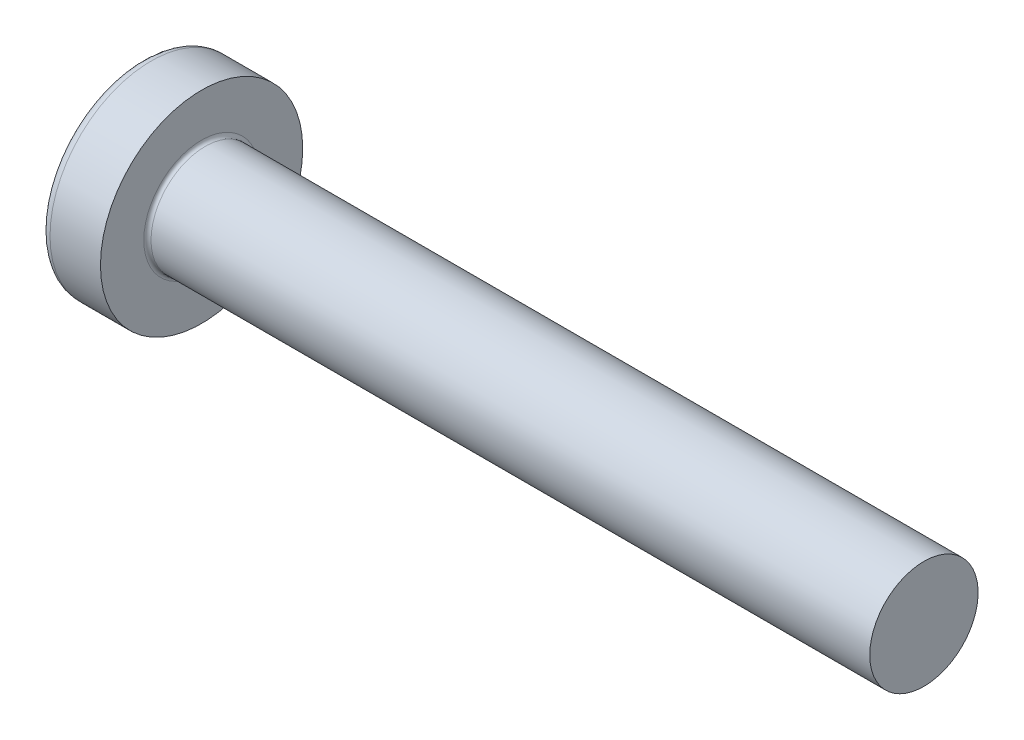
ISO-10303-21;
HEADER;
FILE_DESCRIPTION(('STEP AP214'),'2;1');
FILE_NAME('part.step','',(''),(''),'','','');
FILE_SCHEMA(('AUTOMOTIVE_DESIGN { 1 0 10303 214 1 1 1 1 }'));
ENDSEC;
DATA;
#1=APPLICATION_CONTEXT('core data for automotive mechanical design processes');
#2=APPLICATION_PROTOCOL_DEFINITION('international standard','automotive_design',2000,#1);
#3=PRODUCT_CONTEXT('',#1,'mechanical');
#4=PRODUCT('Part','Part','',(#3));
#5=PRODUCT_RELATED_PRODUCT_CATEGORY('part','',(#4));
#6=PRODUCT_DEFINITION_FORMATION('','',#4);
#7=PRODUCT_DEFINITION_CONTEXT('part definition',#1,'design');
#8=PRODUCT_DEFINITION('design','',#6,#7);
#9=PRODUCT_DEFINITION_SHAPE('','',#8);
#10=(LENGTH_UNIT() NAMED_UNIT(*) SI_UNIT(.MILLI.,.METRE.));
#11=(NAMED_UNIT(*) PLANE_ANGLE_UNIT() SI_UNIT($,.RADIAN.));
#12=(NAMED_UNIT(*) SI_UNIT($,.STERADIAN.) SOLID_ANGLE_UNIT());
#13=UNCERTAINTY_MEASURE_WITH_UNIT(LENGTH_MEASURE(1.E-05),#10,'distance_accuracy_value','');
#14=(GEOMETRIC_REPRESENTATION_CONTEXT(3) GLOBAL_UNCERTAINTY_ASSIGNED_CONTEXT((#13)) GLOBAL_UNIT_ASSIGNED_CONTEXT((#10,
#11,#12)) REPRESENTATION_CONTEXT('',''));
#15=CARTESIAN_POINT('',(0.,0.,0.));
#16=DIRECTION('',(0.,0.,1.));
#17=DIRECTION('',(1.,0.,0.));
#18=AXIS2_PLACEMENT_3D('',#15,#16,#17);
#19=CARTESIAN_POINT('',(5.,0.,0.));
#20=DIRECTION('',(-1.,0.,0.));
#21=DIRECTION('',(0.,1.,0.));
#22=AXIS2_PLACEMENT_3D('',#19,#20,#21);
#23=SPHERICAL_SURFACE('',#22,5.);
#24=CARTESIAN_POINT('',(0.775371598933733,0.,0.));
#25=DIRECTION('',(-1.,0.,0.));
#26=DIRECTION('',(0.,0.,1.));
#27=AXIS2_PLACEMENT_3D('',#24,#25,#26);
#28=CIRCLE('',#27,2.67441860465116);
#29=CARTESIAN_POINT('',(0.775371598933733,0.,2.67441860465116));
#30=VERTEX_POINT('',#29);
#31=EDGE_CURVE('E239',#30,#30,#28,.T.);
#32=ORIENTED_EDGE('',*,*,#31,.T.);
#33=EDGE_LOOP('',(#32));
#34=FACE_BOUND('',#33,.T.);
#35=CARTESIAN_POINT('',(0.0457951200896417,0.,0.));
#36=DIRECTION('',(1.,0.,0.));
#37=DIRECTION('',(0.,0.,-1.));
#38=AXIS2_PLACEMENT_3D('',#35,#36,#37);
#39=CIRCLE('',#38,0.675169614150692);
#40=CARTESIAN_POINT('',(0.0457951200896426,-0.369999999999998,-0.564760133040918));
#41=VERTEX_POINT('',#40);
#42=CARTESIAN_POINT('',(0.0457951200896417,-0.564760133040915,-0.37));
#43=VERTEX_POINT('',#42);
#44=EDGE_CURVE('E375',#41,#43,#39,.F.);
#45=ORIENTED_EDGE('',*,*,#44,.F.);
#46=CARTESIAN_POINT('',(5.,-0.37,0.));
#47=DIRECTION('',(0.,1.,0.));
#48=DIRECTION('',(0.,0.,1.));
#49=AXIS2_PLACEMENT_3D('',#46,#47,#48);
#50=CIRCLE('',#49,4.98629120689917);
#51=CARTESIAN_POINT('',(0.187869734228639,-0.369999999999995,-1.30633162146802));
#52=VERTEX_POINT('',#51);
#53=EDGE_CURVE('E301',#52,#41,#50,.T.);
#54=ORIENTED_EDGE('',*,*,#53,.F.);
#55=CARTESIAN_POINT('',(4.56358262530798,0.,0.875317983305919));
#56=DIRECTION('',(0.446197753347436,0.,-0.894934391398443));
#57=DIRECTION('',(-0.894934391398443,0.,-0.446197753347436));
#58=AXIS2_PLACEMENT_3D('',#55,#56,#57);
#59=CIRCLE('',#58,4.90340272700175);
#60=CARTESIAN_POINT('',(0.18786973422864,0.370000000000005,-1.30633162146802));
#61=VERTEX_POINT('',#60);
#62=EDGE_CURVE('E273',#52,#61,#59,.T.);
#63=ORIENTED_EDGE('',*,*,#62,.T.);
#64=CARTESIAN_POINT('',(5.,0.37,0.));
#65=DIRECTION('',(0.,-1.,0.));
#66=DIRECTION('',(0.,0.,-1.));
#67=AXIS2_PLACEMENT_3D('',#64,#65,#66);
#68=CIRCLE('',#67,4.98629120689917);
#69=CARTESIAN_POINT('',(0.0457951200896425,0.370000000000002,-0.564760133040916));
#70=VERTEX_POINT('',#69);
#71=EDGE_CURVE('E328',#70,#61,#68,.T.);
#72=ORIENTED_EDGE('',*,*,#71,.F.);
#73=CARTESIAN_POINT('',(0.0457951200896417,0.564760133040916,-0.37));
#74=VERTEX_POINT('',#73);
#75=EDGE_CURVE('E394',#74,#70,#39,.F.);
#76=ORIENTED_EDGE('',*,*,#75,.F.);
#77=CARTESIAN_POINT('',(5.,0.,-0.37));
#78=DIRECTION('',(0.,0.,1.));
#79=DIRECTION('',(1.,0.,0.));
#80=AXIS2_PLACEMENT_3D('',#77,#78,#79);
#81=CIRCLE('',#80,4.98629120689917);
#82=CARTESIAN_POINT('',(0.18786973422864,1.30633162146802,-0.37));
#83=VERTEX_POINT('',#82);
#84=EDGE_CURVE('E267',#83,#74,#81,.T.);
#85=ORIENTED_EDGE('',*,*,#84,.F.);
#86=CARTESIAN_POINT('',(4.56358262530798,-0.87531798330592,0.));
#87=DIRECTION('',(0.446197753347436,0.894934391398443,0.));
#88=DIRECTION('',(-0.894934391398442,0.446197753347436,0.));
#89=AXIS2_PLACEMENT_3D('',#86,#87,#88);
#90=CIRCLE('',#89,4.90340272700175);
#91=CARTESIAN_POINT('',(0.18786973422864,1.30633162146802,0.37));
#92=VERTEX_POINT('',#91);
#93=EDGE_CURVE('E270',#83,#92,#90,.T.);
#94=ORIENTED_EDGE('',*,*,#93,.T.);
#95=CARTESIAN_POINT('',(5.,0.,0.37));
#96=DIRECTION('',(0.,0.,-1.));
#97=DIRECTION('',(0.,1.,0.));
#98=AXIS2_PLACEMENT_3D('',#95,#96,#97);
#99=CIRCLE('',#98,4.98629120689917);
#100=CARTESIAN_POINT('',(0.0457951200896417,0.564760133040916,0.37));
#101=VERTEX_POINT('',#100);
#102=EDGE_CURVE('E263',#101,#92,#99,.T.);
#103=ORIENTED_EDGE('',*,*,#102,.F.);
#104=CARTESIAN_POINT('',(0.0457951200896434,0.369999999999998,0.564760133040918));
#105=VERTEX_POINT('',#104);
#106=EDGE_CURVE('E393',#105,#101,#39,.F.);
#107=ORIENTED_EDGE('',*,*,#106,.F.);
#108=CARTESIAN_POINT('',(0.18786973422864,0.369999999999995,1.30633162146802));
#109=VERTEX_POINT('',#108);
#110=EDGE_CURVE('E283',#109,#105,#68,.T.);
#111=ORIENTED_EDGE('',*,*,#110,.F.);
#112=CARTESIAN_POINT('',(4.56358262530798,0.,-0.87531798330592));
#113=DIRECTION('',(0.446197753347436,0.,0.894934391398443));
#114=DIRECTION('',(0.894934391398442,0.,-0.446197753347436));
#115=AXIS2_PLACEMENT_3D('',#112,#113,#114);
#116=CIRCLE('',#115,4.90340272700175);
#117=CARTESIAN_POINT('',(0.18786973422864,-0.370000000000005,1.30633162146802));
#118=VERTEX_POINT('',#117);
#119=EDGE_CURVE('E50',#109,#118,#116,.T.);
#120=ORIENTED_EDGE('',*,*,#119,.T.);
#121=CARTESIAN_POINT('',(0.0457951200896421,-0.370000000000002,0.564760133040916));
#122=VERTEX_POINT('',#121);
#123=EDGE_CURVE('E280',#122,#118,#50,.T.);
#124=ORIENTED_EDGE('',*,*,#123,.F.);
#125=CARTESIAN_POINT('',(0.0457951200896417,-0.564760133040916,0.37));
#126=VERTEX_POINT('',#125);
#127=EDGE_CURVE('E433',#126,#122,#39,.F.);
#128=ORIENTED_EDGE('',*,*,#127,.F.);
#129=CARTESIAN_POINT('',(0.187869734228639,-1.30633162146802,0.37));
#130=VERTEX_POINT('',#129);
#131=EDGE_CURVE('E264',#130,#126,#99,.T.);
#132=ORIENTED_EDGE('',*,*,#131,.F.);
#133=CARTESIAN_POINT('',(4.56358262530798,0.875317983305919,0.));
#134=DIRECTION('',(0.446197753347436,-0.894934391398443,0.));
#135=DIRECTION('',(0.894934391398443,0.446197753347436,0.));
#136=AXIS2_PLACEMENT_3D('',#133,#134,#135);
#137=CIRCLE('',#136,4.90340272700175);
#138=CARTESIAN_POINT('',(0.18786973422864,-1.30633162146802,-0.37));
#139=VERTEX_POINT('',#138);
#140=EDGE_CURVE('E260',#130,#139,#137,.T.);
#141=ORIENTED_EDGE('',*,*,#140,.T.);
#142=EDGE_CURVE('E65',#43,#139,#81,.T.);
#143=ORIENTED_EDGE('',*,*,#142,.F.);
#144=EDGE_LOOP('',(#45,#54,#63,#72,#76,#85,#94,#103,#107,#111,#120,#124,#128,#132,#141,#143));
#145=FACE_BOUND('',#144,.T.);
#146=ADVANCED_FACE('F36',(#34,#145),#23,.T.);
#147=CARTESIAN_POINT('',(1.75,0.527482331818931,-0.37));
#148=DIRECTION('',(0.,0.,1.));
#149=DIRECTION('',(1.,0.,0.));
#150=AXIS2_PLACEMENT_3D('',#147,#148,#149);
#151=PLANE('',#150);
#152=ORIENTED_EDGE('',*,*,#84,.T.);
#153=CARTESIAN_POINT('',(-0.987293237053716,0.649401255967161,-0.37));
#154=CARTESIAN_POINT('',(-0.781914975317084,0.632865887002871,-0.37));
#155=CARTESIAN_POINT('',(-0.576547882393372,0.616188977635081,-0.37));
#156=CARTESIAN_POINT('',(-0.165841599226327,0.582441031964227,-0.37));
#157=CARTESIAN_POINT('',(0.0394975903090452,0.56536998705488,-0.37));
#158=CARTESIAN_POINT('',(0.450133475422572,0.530723441326535,-0.37));
#159=CARTESIAN_POINT('',(0.655430171010573,0.513147940624557,-0.37));
#160=CARTESIAN_POINT('',(1.06596140177934,0.477314957985794,-0.37));
#161=CARTESIAN_POINT('',(1.2711959378071,0.459057485806066,-0.37));
#162=CARTESIAN_POINT('',(1.61065292365626,0.428051938688768,-0.37));
#163=CARTESIAN_POINT('',(1.74490059995643,0.415580824990931,-0.37));
#164=CARTESIAN_POINT('',(2.01334321762763,0.390092023404979,-0.37));
#165=CARTESIAN_POINT('',(2.14753815934577,0.377074339177353,-0.37));
#166=CARTESIAN_POINT('',(2.41586354151957,0.350315629452843,-0.37));
#167=CARTESIAN_POINT('',(2.5499939784531,0.33657456817765,-0.37));
#168=CARTESIAN_POINT('',(2.81814173295471,0.308004077741875,-0.37));
#169=CARTESIAN_POINT('',(2.95215904765134,0.293174621747065,-0.37));
#170=CARTESIAN_POINT('',(3.0860955068368,0.277618485071816,-0.37));
#171=B_SPLINE_CURVE_WITH_KNOTS('',3,(#153,#154,#155,#156,#157,#158,#159,#160,#161,#162,#163,
#164,#165,#166,#167,#168,#169,#170),.UNSPECIFIED.,.F.,.F.,(4,2,2,2,2,2,2,2,4),(0.,
0.618128793984691,1.23627109812525,1.85441325887562,2.4725465791681,2.87702276218609,
3.28149623678161,3.68598973550942,4.09049321032311),.UNSPECIFIED.);
#172=CARTESIAN_POINT('',(1.75,0.415013252800437,-0.37));
#173=VERTEX_POINT('',#172);
#174=EDGE_CURVE('E417',#74,#173,#171,.T.);
#175=ORIENTED_EDGE('',*,*,#174,.T.);
#176=DIRECTION('',(0.,1.,0.));
#177=VECTOR('',#176,1.);
#178=CARTESIAN_POINT('',(1.75,-0.527482331818931,-0.37));
#179=LINE('',#178,#177);
#180=CARTESIAN_POINT('',(1.75,0.527482331818931,-0.37));
#181=VERTEX_POINT('',#180);
#182=EDGE_CURVE('E357',#173,#181,#179,.T.);
#183=ORIENTED_EDGE('',*,*,#182,.T.);
#184=DIRECTION('',(0.894934391398442,-0.446197753347436,0.));
#185=VECTOR('',#184,1.);
#186=CARTESIAN_POINT('',(0.,1.4,-0.37));
#187=LINE('',#186,#185);
#188=EDGE_CURVE('E240',#83,#181,#187,.T.);
#189=ORIENTED_EDGE('',*,*,#188,.F.);
#190=EDGE_LOOP('',(#152,#175,#183,#189));
#191=FACE_BOUND('',#190,.T.);
#192=ADVANCED_FACE('F195',(#191),#151,.T.);
#193=CARTESIAN_POINT('',(1.75,-0.527482331818931,-0.37));
#194=VERTEX_POINT('',#193);
#195=CARTESIAN_POINT('',(1.75,-0.415013252800437,-0.37));
#196=VERTEX_POINT('',#195);
#197=EDGE_CURVE('E248',#194,#196,#179,.T.);
#198=ORIENTED_EDGE('',*,*,#197,.T.);
#199=CARTESIAN_POINT('',(-0.987293237053716,-0.649401255967161,-0.37));
#200=CARTESIAN_POINT('',(-0.781914975317084,-0.632865887002871,-0.37));
#201=CARTESIAN_POINT('',(-0.576547882393372,-0.616188977635081,-0.37));
#202=CARTESIAN_POINT('',(-0.165841599226327,-0.582441031964227,-0.37));
#203=CARTESIAN_POINT('',(0.0394975903090452,-0.56536998705488,-0.37));
#204=CARTESIAN_POINT('',(0.450133475422572,-0.530723441326535,-0.37));
#205=CARTESIAN_POINT('',(0.655430171010573,-0.513147940624557,-0.37));
#206=CARTESIAN_POINT('',(1.06596140177934,-0.477314957985794,-0.37));
#207=CARTESIAN_POINT('',(1.2711959378071,-0.459057485806066,-0.37));
#208=CARTESIAN_POINT('',(1.61065292365626,-0.428051938688768,-0.37));
#209=CARTESIAN_POINT('',(1.74490059995643,-0.415580824990931,-0.37));
#210=CARTESIAN_POINT('',(2.01334321762763,-0.390092023404979,-0.37));
#211=CARTESIAN_POINT('',(2.14753815934577,-0.377074339177353,-0.37));
#212=CARTESIAN_POINT('',(2.41586354151957,-0.350315629452843,-0.37));
#213=CARTESIAN_POINT('',(2.5499939784531,-0.33657456817765,-0.37));
#214=CARTESIAN_POINT('',(2.81814173295471,-0.308004077741875,-0.37));
#215=CARTESIAN_POINT('',(2.95215904765134,-0.293174621747065,-0.37));
#216=CARTESIAN_POINT('',(3.0860955068368,-0.277618485071816,-0.37));
#217=B_SPLINE_CURVE_WITH_KNOTS('',3,(#199,#200,#201,#202,#203,#204,#205,#206,#207,#208,#209,
#210,#211,#212,#213,#214,#215,#216),.UNSPECIFIED.,.F.,.F.,(4,2,2,2,2,2,2,2,4),(0.,
0.618128793984691,1.23627109812525,1.85441325887562,2.4725465791681,2.87702276218609,
3.28149623678161,3.68598973550942,4.09049321032311),.UNSPECIFIED.);
#218=EDGE_CURVE('E392',#196,#43,#217,.F.);
#219=ORIENTED_EDGE('',*,*,#218,.T.);
#220=ORIENTED_EDGE('',*,*,#142,.T.);
#221=DIRECTION('',(0.894934391398442,0.446197753347436,0.));
#222=VECTOR('',#221,1.);
#223=CARTESIAN_POINT('',(0.,-1.4,-0.37));
#224=LINE('',#223,#222);
#225=EDGE_CURVE('E331',#139,#194,#224,.T.);
#226=ORIENTED_EDGE('',*,*,#225,.T.);
#227=EDGE_LOOP('',(#198,#219,#220,#226));
#228=FACE_BOUND('',#227,.T.);
#229=ADVANCED_FACE('F201',(#228),#151,.T.);
#230=CARTESIAN_POINT('',(1.75,-0.527482331818931,0.37));
#231=DIRECTION('',(0.,0.,-1.));
#232=DIRECTION('',(0.,1.,0.));
#233=AXIS2_PLACEMENT_3D('',#230,#231,#232);
#234=PLANE('',#233);
#235=DIRECTION('',(0.,-1.,0.));
#236=VECTOR('',#235,1.);
#237=CARTESIAN_POINT('',(1.75,0.527482331818931,0.37));
#238=LINE('',#237,#236);
#239=CARTESIAN_POINT('',(1.75,0.527482331818931,0.37));
#240=VERTEX_POINT('',#239);
#241=CARTESIAN_POINT('',(1.75,0.415013252800437,0.37));
#242=VERTEX_POINT('',#241);
#243=EDGE_CURVE('E340',#240,#242,#238,.T.);
#244=ORIENTED_EDGE('',*,*,#243,.T.);
#245=CARTESIAN_POINT('',(-0.987293237069635,0.649401255968442,0.37));
#246=CARTESIAN_POINT('',(-0.781914975331301,0.632865887004023,0.37));
#247=CARTESIAN_POINT('',(-0.576547882405888,0.616188977636102,0.37));
#248=CARTESIAN_POINT('',(-0.16584159923544,0.582441031964983,0.37));
#249=CARTESIAN_POINT('',(0.0394975903016338,0.5653699870555,0.37));
#250=CARTESIAN_POINT('',(0.450133475420601,0.530723441326706,0.37));
#251=CARTESIAN_POINT('',(0.655430171012341,0.513147940624409,0.37));
#252=CARTESIAN_POINT('',(1.06596140178858,0.477314957984981,0.37));
#253=CARTESIAN_POINT('',(1.27119593782008,0.459057485804908,0.37));
#254=CARTESIAN_POINT('',(1.61065292367297,0.428051938687225,0.37));
#255=CARTESIAN_POINT('',(1.74490059997313,0.415580824989367,0.37));
#256=CARTESIAN_POINT('',(2.01334321764434,0.39009202340337,0.37));
#257=CARTESIAN_POINT('',(2.14753815936247,0.377074339175718,0.37));
#258=CARTESIAN_POINT('',(2.41586354153627,0.350315629451146,0.37));
#259=CARTESIAN_POINT('',(2.54999397846979,0.336574568175918,0.37));
#260=CARTESIAN_POINT('',(2.8181417329714,0.308004077740054,0.37));
#261=CARTESIAN_POINT('',(2.95215904766802,0.29317462174519,0.37));
#262=CARTESIAN_POINT('',(3.08609550685347,0.277618485069873,0.37));
#263=B_SPLINE_CURVE_WITH_KNOTS('',3,(#245,#246,#247,#248,#249,#250,#251,#252,#253,#254,#255,
#256,#257,#258,#259,#260,#261,#262),.UNSPECIFIED.,.F.,.F.,(4,2,2,2,2,2,2,2,4),(0.,
0.61812879398981,1.23627109813549,1.85441325889711,2.47254657920086,2.87702276221884,
3.28149623681436,3.68598973554218,4.09049321035586),.UNSPECIFIED.);
#264=EDGE_CURVE('E672',#242,#101,#263,.F.);
#265=ORIENTED_EDGE('',*,*,#264,.T.);
#266=ORIENTED_EDGE('',*,*,#102,.T.);
#267=DIRECTION('',(0.894934391398442,-0.446197753347436,0.));
#268=VECTOR('',#267,1.);
#269=CARTESIAN_POINT('',(0.,1.4,0.37));
#270=LINE('',#269,#268);
#271=EDGE_CURVE('E245',#92,#240,#270,.T.);
#272=ORIENTED_EDGE('',*,*,#271,.T.);
#273=EDGE_LOOP('',(#244,#265,#266,#272));
#274=FACE_BOUND('',#273,.T.);
#275=ADVANCED_FACE('F413',(#274),#234,.T.);
#276=ORIENTED_EDGE('',*,*,#131,.T.);
#277=CARTESIAN_POINT('',(-0.987293237069635,-0.649401255968442,0.37));
#278=CARTESIAN_POINT('',(-0.781914975331301,-0.632865887004023,0.37));
#279=CARTESIAN_POINT('',(-0.576547882405888,-0.616188977636102,0.37));
#280=CARTESIAN_POINT('',(-0.16584159923544,-0.582441031964983,0.37));
#281=CARTESIAN_POINT('',(0.0394975903016338,-0.5653699870555,0.37));
#282=CARTESIAN_POINT('',(0.450133475420601,-0.530723441326706,0.37));
#283=CARTESIAN_POINT('',(0.655430171012341,-0.513147940624409,0.37));
#284=CARTESIAN_POINT('',(1.06596140178858,-0.477314957984981,0.37));
#285=CARTESIAN_POINT('',(1.27119593782008,-0.459057485804908,0.37));
#286=CARTESIAN_POINT('',(1.61065292367297,-0.428051938687225,0.37));
#287=CARTESIAN_POINT('',(1.74490059997313,-0.415580824989367,0.37));
#288=CARTESIAN_POINT('',(2.01334321764434,-0.390092023403371,0.37));
#289=CARTESIAN_POINT('',(2.14753815936247,-0.377074339175718,0.37));
#290=CARTESIAN_POINT('',(2.41586354153627,-0.350315629451146,0.37));
#291=CARTESIAN_POINT('',(2.54999397846979,-0.336574568175918,0.37));
#292=CARTESIAN_POINT('',(2.8181417329714,-0.308004077740054,0.37));
#293=CARTESIAN_POINT('',(2.95215904766802,-0.29317462174519,0.37));
#294=CARTESIAN_POINT('',(3.08609550685347,-0.277618485069873,0.37));
#295=B_SPLINE_CURVE_WITH_KNOTS('',3,(#277,#278,#279,#280,#281,#282,#283,#284,#285,#286,#287,
#288,#289,#290,#291,#292,#293,#294),.UNSPECIFIED.,.F.,.F.,(4,2,2,2,2,2,2,2,4),(0.,
0.61812879398981,1.23627109813549,1.85441325889711,2.47254657920086,2.87702276221884,
3.28149623681436,3.68598973554218,4.09049321035586),.UNSPECIFIED.);
#296=CARTESIAN_POINT('',(1.75,-0.415013252800437,0.37));
#297=VERTEX_POINT('',#296);
#298=EDGE_CURVE('E434',#126,#297,#295,.T.);
#299=ORIENTED_EDGE('',*,*,#298,.T.);
#300=CARTESIAN_POINT('',(1.75,-0.527482331818932,0.37));
#301=VERTEX_POINT('',#300);
#302=EDGE_CURVE('E342',#297,#301,#238,.T.);
#303=ORIENTED_EDGE('',*,*,#302,.T.);
#304=DIRECTION('',(0.894934391398443,0.446197753347436,0.));
#305=VECTOR('',#304,1.);
#306=CARTESIAN_POINT('',(0.,-1.4,0.37));
#307=LINE('',#306,#305);
#308=EDGE_CURVE('E333',#130,#301,#307,.T.);
#309=ORIENTED_EDGE('',*,*,#308,.F.);
#310=EDGE_LOOP('',(#276,#299,#303,#309));
#311=FACE_BOUND('',#310,.T.);
#312=ADVANCED_FACE('F520',(#311),#234,.T.);
#313=CARTESIAN_POINT('',(1.75,0.527482331818931,0.37));
#314=DIRECTION('',(0.446197753347436,0.894934391398443,0.));
#315=DIRECTION('',(-0.894934391398442,0.446197753347436,0.));
#316=AXIS2_PLACEMENT_3D('',#313,#314,#315);
#317=PLANE('',#316);
#318=CARTESIAN_POINT('',(2.6696526882832,0.0689604923233249,0.));
#319=DIRECTION('',(0.446197753347436,0.894934391398443,0.));
#320=DIRECTION('',(-0.894934391398443,0.446197753347436,0.));
#321=AXIS2_PLACEMENT_3D('',#318,#319,#320);
#322=ELLIPSE('',#321,1.10195897609154,0.486831694838766);
#323=CARTESIAN_POINT('',(1.75,0.527482331818932,0.175779377683682));
#324=VERTEX_POINT('',#323);
#325=CARTESIAN_POINT('',(1.75,0.527482331818932,-0.175779377683682));
#326=VERTEX_POINT('',#325);
#327=EDGE_CURVE('E306',#324,#326,#322,.F.);
#328=ORIENTED_EDGE('',*,*,#327,.F.);
#329=DIRECTION('',(0.,0.,-1.));
#330=VECTOR('',#329,1.);
#331=CARTESIAN_POINT('',(1.75,0.527482331818931,0.37));
#332=LINE('',#331,#330);
#333=EDGE_CURVE('E343',#240,#324,#332,.T.);
#334=ORIENTED_EDGE('',*,*,#333,.F.);
#335=ORIENTED_EDGE('',*,*,#271,.F.);
#336=ORIENTED_EDGE('',*,*,#93,.F.);
#337=ORIENTED_EDGE('',*,*,#188,.T.);
#338=EDGE_CURVE('E345',#326,#181,#332,.T.);
#339=ORIENTED_EDGE('',*,*,#338,.F.);
#340=EDGE_LOOP('',(#328,#334,#335,#336,#337,#339));
#341=FACE_BOUND('',#340,.T.);
#342=ADVANCED_FACE('F411',(#341),#317,.F.);
#343=CARTESIAN_POINT('',(0.,-1.4,-0.37));
#344=DIRECTION('',(0.446197753347436,-0.894934391398443,0.));
#345=DIRECTION('',(0.894934391398443,0.446197753347436,0.));
#346=AXIS2_PLACEMENT_3D('',#343,#344,#345);
#347=PLANE('',#346);
#348=CARTESIAN_POINT('',(2.6696526882832,-0.0689604923233252,0.));
#349=DIRECTION('',(0.446197753347436,-0.894934391398443,0.));
#350=DIRECTION('',(-0.894934391398443,-0.446197753347436,0.));
#351=AXIS2_PLACEMENT_3D('',#348,#349,#350);
#352=ELLIPSE('',#351,1.10195897609154,0.486831694838766);
#353=CARTESIAN_POINT('',(1.75,-0.527482331818932,-0.175779377683681));
#354=VERTEX_POINT('',#353);
#355=CARTESIAN_POINT('',(1.75,-0.527482331818932,0.175779377683681));
#356=VERTEX_POINT('',#355);
#357=EDGE_CURVE('E674',#354,#356,#352,.F.);
#358=ORIENTED_EDGE('',*,*,#357,.F.);
#359=DIRECTION('',(0.,0.,1.));
#360=VECTOR('',#359,1.);
#361=CARTESIAN_POINT('',(1.75,-0.527482331818931,-0.37));
#362=LINE('',#361,#360);
#363=EDGE_CURVE('E336',#194,#354,#362,.T.);
#364=ORIENTED_EDGE('',*,*,#363,.F.);
#365=ORIENTED_EDGE('',*,*,#225,.F.);
#366=ORIENTED_EDGE('',*,*,#140,.F.);
#367=ORIENTED_EDGE('',*,*,#308,.T.);
#368=EDGE_CURVE('E339',#356,#301,#362,.T.);
#369=ORIENTED_EDGE('',*,*,#368,.F.);
#370=EDGE_LOOP('',(#358,#364,#365,#366,#367,#369));
#371=FACE_BOUND('',#370,.T.);
#372=ADVANCED_FACE('F507',(#371),#347,.F.);
#373=CARTESIAN_POINT('',(1.75,0.527482331818931,-0.37));
#374=DIRECTION('',(-1.,0.,0.));
#375=DIRECTION('',(0.,0.,1.));
#376=AXIS2_PLACEMENT_3D('',#373,#374,#375);
#377=PLANE('',#376);
#378=DIRECTION('',(0.,1.,0.));
#379=VECTOR('',#378,1.);
#380=CARTESIAN_POINT('',(1.75,-0.370000000000002,0.52748233181893));
#381=LINE('',#380,#379);
#382=CARTESIAN_POINT('',(1.75,-0.370000000000002,0.52748233181893));
#383=VERTEX_POINT('',#382);
#384=CARTESIAN_POINT('',(1.75,-0.175779377683686,0.52748233181893));
#385=VERTEX_POINT('',#384);
#386=EDGE_CURVE('E321',#383,#385,#381,.T.);
#387=ORIENTED_EDGE('',*,*,#386,.T.);
#388=CARTESIAN_POINT('',(1.75,0.,0.));
#389=DIRECTION('',(-1.,0.,0.));
#390=DIRECTION('',(0.,0.,1.));
#391=AXIS2_PLACEMENT_3D('',#388,#389,#390);
#392=CIRCLE('',#391,0.556);
#393=CARTESIAN_POINT('',(1.75,-0.370000000000001,0.415013252800436));
#394=VERTEX_POINT('',#393);
#395=EDGE_CURVE('E702',#394,#385,#392,.T.);
#396=ORIENTED_EDGE('',*,*,#395,.F.);
#397=DIRECTION('',(0.,0.,-1.));
#398=VECTOR('',#397,1.);
#399=CARTESIAN_POINT('',(1.75,-0.370000000000002,0.52748233181893));
#400=LINE('',#399,#398);
#401=EDGE_CURVE('E317',#383,#394,#400,.T.);
#402=ORIENTED_EDGE('',*,*,#401,.F.);
#403=EDGE_LOOP('',(#387,#396,#402));
#404=FACE_BOUND('',#403,.T.);
#405=ADVANCED_FACE('F500',(#404),#377,.T.);
#406=ORIENTED_EDGE('',*,*,#302,.F.);
#407=EDGE_CURVE('E707',#356,#297,#392,.T.);
#408=ORIENTED_EDGE('',*,*,#407,.F.);
#409=ORIENTED_EDGE('',*,*,#368,.T.);
#410=EDGE_LOOP('',(#406,#408,#409));
#411=FACE_BOUND('',#410,.T.);
#412=ADVANCED_FACE('F493',(#411),#377,.T.);
#413=ORIENTED_EDGE('',*,*,#363,.T.);
#414=EDGE_CURVE('E386',#196,#354,#392,.T.);
#415=ORIENTED_EDGE('',*,*,#414,.F.);
#416=ORIENTED_EDGE('',*,*,#197,.F.);
#417=EDGE_LOOP('',(#413,#415,#416));
#418=FACE_BOUND('',#417,.T.);
#419=ADVANCED_FACE('F487',(#418),#377,.T.);
#420=CARTESIAN_POINT('',(1.75,-0.369999999999998,-0.415013252800438));
#421=VERTEX_POINT('',#420);
#422=CARTESIAN_POINT('',(1.75,-0.369999999999998,-0.527482331818933));
#423=VERTEX_POINT('',#422);
#424=EDGE_CURVE('E320',#421,#423,#400,.T.);
#425=ORIENTED_EDGE('',*,*,#424,.F.);
#426=CARTESIAN_POINT('',(1.75,-0.17577937768368,-0.527482331818932));
#427=VERTEX_POINT('',#426);
#428=EDGE_CURVE('E57',#427,#421,#392,.T.);
#429=ORIENTED_EDGE('',*,*,#428,.F.);
#430=DIRECTION('',(0.,-1.,0.));
#431=VECTOR('',#430,1.);
#432=CARTESIAN_POINT('',(1.75,0.370000000000002,-0.52748233181893));
#433=LINE('',#432,#431);
#434=EDGE_CURVE('E316',#427,#423,#433,.T.);
#435=ORIENTED_EDGE('',*,*,#434,.T.);
#436=EDGE_LOOP('',(#425,#429,#435));
#437=FACE_BOUND('',#436,.T.);
#438=ADVANCED_FACE('F381',(#437),#377,.T.);
#439=CARTESIAN_POINT('',(1.75,0.370000000000002,-0.52748233181893));
#440=VERTEX_POINT('',#439);
#441=CARTESIAN_POINT('',(1.75,0.175779377683684,-0.527482331818931));
#442=VERTEX_POINT('',#441);
#443=EDGE_CURVE('E313',#440,#442,#433,.T.);
#444=ORIENTED_EDGE('',*,*,#443,.T.);
#445=CARTESIAN_POINT('',(1.75,0.370000000000001,-0.415013252800436));
#446=VERTEX_POINT('',#445);
#447=EDGE_CURVE('E385',#446,#442,#392,.T.);
#448=ORIENTED_EDGE('',*,*,#447,.F.);
#449=DIRECTION('',(0.,0.,1.));
#450=VECTOR('',#449,1.);
#451=CARTESIAN_POINT('',(1.75,0.370000000000002,-0.52748233181893));
#452=LINE('',#451,#450);
#453=EDGE_CURVE('E325',#440,#446,#452,.T.);
#454=ORIENTED_EDGE('',*,*,#453,.F.);
#455=EDGE_LOOP('',(#444,#448,#454));
#456=FACE_BOUND('',#455,.T.);
#457=ADVANCED_FACE('F475',(#456),#377,.T.);
#458=ORIENTED_EDGE('',*,*,#182,.F.);
#459=EDGE_CURVE('E691',#326,#173,#392,.T.);
#460=ORIENTED_EDGE('',*,*,#459,.F.);
#461=ORIENTED_EDGE('',*,*,#338,.T.);
#462=EDGE_LOOP('',(#458,#460,#461));
#463=FACE_BOUND('',#462,.T.);
#464=ADVANCED_FACE('F468',(#463),#377,.T.);
#465=ORIENTED_EDGE('',*,*,#333,.T.);
#466=EDGE_CURVE('E693',#242,#324,#392,.T.);
#467=ORIENTED_EDGE('',*,*,#466,.F.);
#468=ORIENTED_EDGE('',*,*,#243,.F.);
#469=EDGE_LOOP('',(#465,#467,#468));
#470=FACE_BOUND('',#469,.T.);
#471=ADVANCED_FACE('F462',(#470),#377,.T.);
#472=CARTESIAN_POINT('',(1.75,0.369999999999998,0.527482331818932));
#473=DIRECTION('',(0.,-1.,0.));
#474=DIRECTION('',(1.,0.,0.));
#475=AXIS2_PLACEMENT_3D('',#472,#473,#474);
#476=PLANE('',#475);
#477=ORIENTED_EDGE('',*,*,#110,.T.);
#478=CARTESIAN_POINT('',(-0.987293237069635,0.369999999999998,0.649401255968443));
#479=CARTESIAN_POINT('',(-0.781914975331301,0.369999999999998,0.632865887004024));
#480=CARTESIAN_POINT('',(-0.576547882405888,0.369999999999998,0.616188977636103));
#481=CARTESIAN_POINT('',(-0.16584159923544,0.369999999999998,0.582441031964984));
#482=CARTESIAN_POINT('',(0.0394975903016338,0.369999999999998,0.565369987055501));
#483=CARTESIAN_POINT('',(0.450133475420601,0.369999999999998,0.530723441326707));
#484=CARTESIAN_POINT('',(0.655430171012341,0.369999999999998,0.51314794062441));
#485=CARTESIAN_POINT('',(1.06596140178858,0.369999999999998,0.477314957984982));
#486=CARTESIAN_POINT('',(1.27119593782008,0.369999999999998,0.459057485804909));
#487=CARTESIAN_POINT('',(1.61065292367297,0.369999999999999,0.428051938687226));
#488=CARTESIAN_POINT('',(1.74490059997313,0.369999999999999,0.415580824989369));
#489=CARTESIAN_POINT('',(2.01334321764434,0.369999999999999,0.390092023403372));
#490=CARTESIAN_POINT('',(2.14753815936247,0.369999999999999,0.37707433917572));
#491=CARTESIAN_POINT('',(2.41586354153627,0.369999999999999,0.350315629451147));
#492=CARTESIAN_POINT('',(2.54999397846979,0.369999999999999,0.336574568175919));
#493=CARTESIAN_POINT('',(2.8181417329714,0.369999999999999,0.308004077740055));
#494=CARTESIAN_POINT('',(2.95215904766802,0.369999999999999,0.293174621745191));
#495=CARTESIAN_POINT('',(3.08609550685347,0.369999999999999,0.277618485069875));
#496=B_SPLINE_CURVE_WITH_KNOTS('',3,(#478,#479,#480,#481,#482,#483,#484,#485,#486,#487,#488,
#489,#490,#491,#492,#493,#494,#495),.UNSPECIFIED.,.F.,.F.,(4,2,2,2,2,2,2,2,4),(0.,
0.61812879398981,1.23627109813549,1.85441325889711,2.47254657920086,2.87702276221884,
3.28149623681436,3.68598973554218,4.09049321035586),.UNSPECIFIED.);
#497=CARTESIAN_POINT('',(1.75,0.369999999999999,0.415013252800439));
#498=VERTEX_POINT('',#497);
#499=EDGE_CURVE('E671',#105,#498,#496,.T.);
#500=ORIENTED_EDGE('',*,*,#499,.T.);
#501=CARTESIAN_POINT('',(1.75,0.369999999999998,0.527482331818932));
#502=VERTEX_POINT('',#501);
#503=EDGE_CURVE('E298',#498,#502,#452,.T.);
#504=ORIENTED_EDGE('',*,*,#503,.T.);
#505=DIRECTION('',(0.894934391398442,0.,-0.446197753347436));
#506=VECTOR('',#505,1.);
#507=CARTESIAN_POINT('',(0.,0.369999999999995,1.4));
#508=LINE('',#507,#506);
#509=EDGE_CURVE('E291',#109,#502,#508,.T.);
#510=ORIENTED_EDGE('',*,*,#509,.F.);
#511=EDGE_LOOP('',(#477,#500,#504,#510));
#512=FACE_BOUND('',#511,.T.);
#513=ADVANCED_FACE('F295',(#512),#476,.T.);
#514=CARTESIAN_POINT('',(1.75,-0.369999999999998,-0.527482331818933));
#515=DIRECTION('',(0.,1.,0.));
#516=DIRECTION('',(0.,0.,1.));
#517=AXIS2_PLACEMENT_3D('',#514,#515,#516);
#518=PLANE('',#517);
#519=ORIENTED_EDGE('',*,*,#401,.T.);
#520=CARTESIAN_POINT('',(-0.987293237053716,-0.370000000000002,0.649401255967159));
#521=CARTESIAN_POINT('',(-0.781914975317084,-0.370000000000002,0.63286588700287));
#522=CARTESIAN_POINT('',(-0.576547882393372,-0.370000000000002,0.616188977635079));
#523=CARTESIAN_POINT('',(-0.165841599226327,-0.370000000000002,0.582441031964225));
#524=CARTESIAN_POINT('',(0.039497590309045,-0.370000000000002,0.565369987054878));
#525=CARTESIAN_POINT('',(0.450133475422572,-0.370000000000002,0.530723441326534));
#526=CARTESIAN_POINT('',(0.655430171010573,-0.370000000000002,0.513147940624556));
#527=CARTESIAN_POINT('',(1.06596140177934,-0.370000000000002,0.477314957985792));
#528=CARTESIAN_POINT('',(1.2711959378071,-0.370000000000002,0.459057485806065));
#529=CARTESIAN_POINT('',(1.61065292365626,-0.370000000000001,0.428051938688767));
#530=CARTESIAN_POINT('',(1.74490059995642,-0.370000000000001,0.41558082499093));
#531=CARTESIAN_POINT('',(2.01334321762763,-0.370000000000001,0.390092023404978));
#532=CARTESIAN_POINT('',(2.14753815934577,-0.370000000000001,0.377074339177352));
#533=CARTESIAN_POINT('',(2.41586354151957,-0.370000000000001,0.350315629452841));
#534=CARTESIAN_POINT('',(2.5499939784531,-0.370000000000001,0.336574568177649));
#535=CARTESIAN_POINT('',(2.81814173295471,-0.370000000000001,0.308004077741874));
#536=CARTESIAN_POINT('',(2.95215904765134,-0.370000000000001,0.293174621747064));
#537=CARTESIAN_POINT('',(3.0860955068368,-0.370000000000001,0.277618485071814));
#538=B_SPLINE_CURVE_WITH_KNOTS('',3,(#520,#521,#522,#523,#524,#525,#526,#527,#528,#529,#530,
#531,#532,#533,#534,#535,#536,#537),.UNSPECIFIED.,.F.,.F.,(4,2,2,2,2,2,2,2,4),(0.,
0.618128793984691,1.23627109812525,1.85441325887562,2.4725465791681,2.87702276218609,
3.28149623678161,3.68598973550942,4.09049321032311),.UNSPECIFIED.);
#539=EDGE_CURVE('E426',#394,#122,#538,.F.);
#540=ORIENTED_EDGE('',*,*,#539,.T.);
#541=ORIENTED_EDGE('',*,*,#123,.T.);
#542=DIRECTION('',(0.894934391398442,0.,-0.446197753347436));
#543=VECTOR('',#542,1.);
#544=CARTESIAN_POINT('',(0.,-0.370000000000005,1.4));
#545=LINE('',#544,#543);
#546=EDGE_CURVE('E293',#118,#383,#545,.T.);
#547=ORIENTED_EDGE('',*,*,#546,.T.);
#548=EDGE_LOOP('',(#519,#540,#541,#547));
#549=FACE_BOUND('',#548,.T.);
#550=ADVANCED_FACE('F230',(#549),#518,.T.);
#551=CARTESIAN_POINT('',(1.75,-0.370000000000002,0.52748233181893));
#552=DIRECTION('',(0.446197753347436,0.,0.894934391398443));
#553=DIRECTION('',(-0.894934391398442,0.,0.446197753347436));
#554=AXIS2_PLACEMENT_3D('',#551,#552,#553);
#555=PLANE('',#554);
#556=CARTESIAN_POINT('',(2.6696526882832,0.,0.0689604923233248));
#557=DIRECTION('',(0.446197753347436,0.,0.894934391398443));
#558=DIRECTION('',(-0.894934391398443,0.,0.446197753347436));
#559=AXIS2_PLACEMENT_3D('',#556,#557,#558);
#560=ELLIPSE('',#559,1.10195897609154,0.486831694838766);
#561=CARTESIAN_POINT('',(1.75,0.175779377683682,0.527482331818932));
#562=VERTEX_POINT('',#561);
#563=EDGE_CURVE('E424',#385,#562,#560,.F.);
#564=ORIENTED_EDGE('',*,*,#563,.F.);
#565=ORIENTED_EDGE('',*,*,#386,.F.);
#566=ORIENTED_EDGE('',*,*,#546,.F.);
#567=ORIENTED_EDGE('',*,*,#119,.F.);
#568=ORIENTED_EDGE('',*,*,#509,.T.);
#569=EDGE_CURVE('E324',#562,#502,#381,.T.);
#570=ORIENTED_EDGE('',*,*,#569,.F.);
#571=EDGE_LOOP('',(#564,#565,#566,#567,#568,#570));
#572=FACE_BOUND('',#571,.T.);
#573=ADVANCED_FACE('F289',(#572),#555,.F.);
#574=CARTESIAN_POINT('',(0.,0.370000000000005,-1.4));
#575=DIRECTION('',(0.446197753347436,0.,-0.894934391398443));
#576=DIRECTION('',(0.894934391398443,0.,0.446197753347436));
#577=AXIS2_PLACEMENT_3D('',#574,#575,#576);
#578=PLANE('',#577);
#579=CARTESIAN_POINT('',(2.6696526882832,0.,-0.0689604923233253));
#580=DIRECTION('',(0.446197753347436,0.,-0.894934391398443));
#581=DIRECTION('',(-0.894934391398443,0.,-0.446197753347436));
#582=AXIS2_PLACEMENT_3D('',#579,#580,#581);
#583=ELLIPSE('',#582,1.10195897609154,0.486831694838766);
#584=EDGE_CURVE('E379',#442,#427,#583,.F.);
#585=ORIENTED_EDGE('',*,*,#584,.F.);
#586=ORIENTED_EDGE('',*,*,#443,.F.);
#587=DIRECTION('',(0.894934391398442,0.,0.446197753347436));
#588=VECTOR('',#587,1.);
#589=CARTESIAN_POINT('',(0.,0.370000000000005,-1.4));
#590=LINE('',#589,#588);
#591=EDGE_CURVE('E303',#61,#440,#590,.T.);
#592=ORIENTED_EDGE('',*,*,#591,.F.);
#593=ORIENTED_EDGE('',*,*,#62,.F.);
#594=DIRECTION('',(0.894934391398443,0.,0.446197753347436));
#595=VECTOR('',#594,1.);
#596=CARTESIAN_POINT('',(0.,-0.369999999999995,-1.4));
#597=LINE('',#596,#595);
#598=EDGE_CURVE('E310',#52,#423,#597,.T.);
#599=ORIENTED_EDGE('',*,*,#598,.T.);
#600=ORIENTED_EDGE('',*,*,#434,.F.);
#601=EDGE_LOOP('',(#585,#586,#592,#593,#599,#600));
#602=FACE_BOUND('',#601,.T.);
#603=ADVANCED_FACE('F370',(#602),#578,.F.);
#604=ORIENTED_EDGE('',*,*,#453,.T.);
#605=CARTESIAN_POINT('',(-0.987293237053716,0.370000000000002,-0.649401255967159));
#606=CARTESIAN_POINT('',(-0.781914975317084,0.370000000000002,-0.63286588700287));
#607=CARTESIAN_POINT('',(-0.576547882393372,0.370000000000002,-0.61618897763508));
#608=CARTESIAN_POINT('',(-0.165841599226327,0.370000000000002,-0.582441031964225));
#609=CARTESIAN_POINT('',(0.039497590309045,0.370000000000002,-0.565369987054878));
#610=CARTESIAN_POINT('',(0.450133475422572,0.370000000000002,-0.530723441326533));
#611=CARTESIAN_POINT('',(0.655430171010573,0.370000000000002,-0.513147940624555));
#612=CARTESIAN_POINT('',(1.06596140177934,0.370000000000002,-0.477314957985793));
#613=CARTESIAN_POINT('',(1.2711959378071,0.370000000000002,-0.459057485806065));
#614=CARTESIAN_POINT('',(1.61065292365626,0.370000000000001,-0.428051938688767));
#615=CARTESIAN_POINT('',(1.74490059995642,0.370000000000001,-0.41558082499093));
#616=CARTESIAN_POINT('',(2.01334321762763,0.370000000000001,-0.390092023404978));
#617=CARTESIAN_POINT('',(2.14753815934577,0.370000000000001,-0.377074339177352));
#618=CARTESIAN_POINT('',(2.41586354151957,0.370000000000001,-0.350315629452841));
#619=CARTESIAN_POINT('',(2.5499939784531,0.370000000000001,-0.336574568177649));
#620=CARTESIAN_POINT('',(2.81814173295471,0.370000000000001,-0.308004077741874));
#621=CARTESIAN_POINT('',(2.95215904765134,0.370000000000001,-0.293174621747064));
#622=CARTESIAN_POINT('',(3.0860955068368,0.370000000000001,-0.277618485071814));
#623=B_SPLINE_CURVE_WITH_KNOTS('',3,(#605,#606,#607,#608,#609,#610,#611,#612,#613,#614,#615,
#616,#617,#618,#619,#620,#621,#622),.UNSPECIFIED.,.F.,.F.,(4,2,2,2,2,2,2,2,4),(0.,
0.618128793984691,1.23627109812525,1.85441325887562,2.4725465791681,2.87702276218609,
3.28149623678161,3.68598973550942,4.09049321032311),.UNSPECIFIED.);
#624=EDGE_CURVE('E366',#446,#70,#623,.F.);
#625=ORIENTED_EDGE('',*,*,#624,.T.);
#626=ORIENTED_EDGE('',*,*,#71,.T.);
#627=ORIENTED_EDGE('',*,*,#591,.T.);
#628=EDGE_LOOP('',(#604,#625,#626,#627));
#629=FACE_BOUND('',#628,.T.);
#630=ADVANCED_FACE('F228',(#629),#476,.T.);
#631=ORIENTED_EDGE('',*,*,#53,.T.);
#632=CARTESIAN_POINT('',(-0.987293237053716,-0.369999999999998,-0.649401255967162));
#633=CARTESIAN_POINT('',(-0.781914975317084,-0.369999999999998,-0.632865887002873));
#634=CARTESIAN_POINT('',(-0.576547882393372,-0.369999999999998,-0.616188977635082));
#635=CARTESIAN_POINT('',(-0.165841599226327,-0.369999999999998,-0.582441031964228));
#636=CARTESIAN_POINT('',(0.0394975903090453,-0.369999999999998,-0.565369987054881));
#637=CARTESIAN_POINT('',(0.450133475422572,-0.369999999999998,-0.530723441326536));
#638=CARTESIAN_POINT('',(0.655430171010573,-0.369999999999998,-0.513147940624558));
#639=CARTESIAN_POINT('',(1.06596140177934,-0.369999999999998,-0.477314957985795));
#640=CARTESIAN_POINT('',(1.2711959378071,-0.369999999999998,-0.459057485806067));
#641=CARTESIAN_POINT('',(1.61065292365626,-0.369999999999998,-0.42805193868877));
#642=CARTESIAN_POINT('',(1.74490059995643,-0.369999999999998,-0.415580824990932));
#643=CARTESIAN_POINT('',(2.01334321762763,-0.369999999999999,-0.390092023404981));
#644=CARTESIAN_POINT('',(2.14753815934577,-0.369999999999999,-0.377074339177355));
#645=CARTESIAN_POINT('',(2.41586354151957,-0.369999999999999,-0.350315629452844));
#646=CARTESIAN_POINT('',(2.5499939784531,-0.369999999999999,-0.336574568177652));
#647=CARTESIAN_POINT('',(2.81814173295471,-0.369999999999999,-0.308004077741877));
#648=CARTESIAN_POINT('',(2.95215904765134,-0.369999999999999,-0.293174621747066));
#649=CARTESIAN_POINT('',(3.0860955068368,-0.369999999999999,-0.277618485071817));
#650=B_SPLINE_CURVE_WITH_KNOTS('',3,(#632,#633,#634,#635,#636,#637,#638,#639,#640,#641,#642,
#643,#644,#645,#646,#647,#648,#649),.UNSPECIFIED.,.F.,.F.,(4,2,2,2,2,2,2,2,4),(0.,
0.618128793984691,1.23627109812525,1.85441325887562,2.4725465791681,2.87702276218609,
3.28149623678161,3.68598973550942,4.09049321032311),.UNSPECIFIED.);
#651=EDGE_CURVE('E11',#41,#421,#650,.T.);
#652=ORIENTED_EDGE('',*,*,#651,.T.);
#653=ORIENTED_EDGE('',*,*,#424,.T.);
#654=ORIENTED_EDGE('',*,*,#598,.F.);
#655=EDGE_LOOP('',(#631,#652,#653,#654));
#656=FACE_BOUND('',#655,.T.);
#657=ADVANCED_FACE('F223',(#656),#518,.T.);
#658=CARTESIAN_POINT('',(-25.4,0.,0.));
#659=DIRECTION('',(-1.,0.,0.));
#660=DIRECTION('',(0.,0.,1.));
#661=AXIS2_PLACEMENT_3D('',#658,#659,#660);
#662=CYLINDRICAL_SURFACE('',#661,1.5);
#663=CARTESIAN_POINT('',(2.5,0.,0.));
#664=DIRECTION('',(-1.,0.,0.));
#665=DIRECTION('',(0.,0.,1.));
#666=AXIS2_PLACEMENT_3D('',#663,#664,#665);
#667=CIRCLE('',#666,1.5);
#668=CARTESIAN_POINT('',(2.5,0.,1.5));
#669=VERTEX_POINT('',#668);
#670=EDGE_CURVE('E234',#669,#669,#667,.F.);
#671=ORIENTED_EDGE('',*,*,#670,.T.);
#672=EDGE_LOOP('',(#671));
#673=FACE_BOUND('',#672,.T.);
#674=CARTESIAN_POINT('',(22.4,0.,0.));
#675=DIRECTION('',(-1.,0.,0.));
#676=DIRECTION('',(0.,0.,1.));
#677=AXIS2_PLACEMENT_3D('',#674,#675,#676);
#678=CIRCLE('',#677,1.5);
#679=CARTESIAN_POINT('',(22.4,0.,1.5));
#680=VERTEX_POINT('',#679);
#681=EDGE_CURVE('E237',#680,#680,#678,.T.);
#682=ORIENTED_EDGE('',*,*,#681,.T.);
#683=EDGE_LOOP('',(#682));
#684=FACE_BOUND('',#683,.T.);
#685=ADVANCED_FACE('F220',(#673,#684),#662,.T.);
#686=CARTESIAN_POINT('',(2.4,1.5,0.));
#687=DIRECTION('',(-1.,0.,0.));
#688=DIRECTION('',(0.,0.,1.));
#689=AXIS2_PLACEMENT_3D('',#686,#687,#688);
#690=PLANE('',#689);
#691=CARTESIAN_POINT('',(2.4,0.,0.));
#692=DIRECTION('',(-1.,0.,0.));
#693=DIRECTION('',(0.,0.,1.));
#694=AXIS2_PLACEMENT_3D('',#691,#692,#693);
#695=CIRCLE('',#694,1.6);
#696=CARTESIAN_POINT('',(2.4,0.,1.6));
#697=VERTEX_POINT('',#696);
#698=EDGE_CURVE('E256',#697,#697,#695,.T.);
#699=ORIENTED_EDGE('',*,*,#698,.T.);
#700=EDGE_LOOP('',(#699));
#701=FACE_BOUND('',#700,.T.);
#702=CARTESIAN_POINT('',(2.4,0.,0.));
#703=DIRECTION('',(-1.,0.,0.));
#704=DIRECTION('',(0.,0.,1.));
#705=AXIS2_PLACEMENT_3D('',#702,#703,#704);
#706=CIRCLE('',#705,2.8);
#707=CARTESIAN_POINT('',(2.4,0.,2.8));
#708=VERTEX_POINT('',#707);
#709=EDGE_CURVE('E253',#708,#708,#706,.T.);
#710=ORIENTED_EDGE('',*,*,#709,.F.);
#711=EDGE_LOOP('',(#710));
#712=FACE_BOUND('',#711,.T.);
#713=ADVANCED_FACE('F217',(#701,#712),#690,.F.);
#714=CARTESIAN_POINT('',(-25.4,0.,0.));
#715=DIRECTION('',(-1.,0.,0.));
#716=DIRECTION('',(0.,0.,1.));
#717=AXIS2_PLACEMENT_3D('',#714,#715,#716);
#718=CYLINDRICAL_SURFACE('',#717,2.8);
#719=ORIENTED_EDGE('',*,*,#709,.T.);
#720=EDGE_LOOP('',(#719));
#721=FACE_BOUND('',#720,.T.);
#722=CARTESIAN_POINT('',(1.00350153259131,0.,0.));
#723=DIRECTION('',(-1.,0.,0.));
#724=DIRECTION('',(0.,0.,1.));
#725=AXIS2_PLACEMENT_3D('',#722,#723,#724);
#726=CIRCLE('',#725,2.8);
#727=CARTESIAN_POINT('',(1.00350153259131,0.,2.8));
#728=VERTEX_POINT('',#727);
#729=EDGE_CURVE('E242',#728,#728,#726,.T.);
#730=ORIENTED_EDGE('',*,*,#729,.F.);
#731=EDGE_LOOP('',(#730));
#732=FACE_BOUND('',#731,.T.);
#733=ADVANCED_FACE('F213',(#721,#732),#718,.T.);
#734=CARTESIAN_POINT('',(1.00350153259131,0.,0.));
#735=DIRECTION('',(-1.,0.,0.));
#736=DIRECTION('',(0.,0.,1.));
#737=AXIS2_PLACEMENT_3D('',#734,#735,#736);
#738=TOROIDAL_SURFACE('',#737,2.53,0.27);
#739=ORIENTED_EDGE('',*,*,#729,.T.);
#740=EDGE_LOOP('',(#739));
#741=FACE_BOUND('',#740,.T.);
#742=ORIENTED_EDGE('',*,*,#31,.F.);
#743=EDGE_LOOP('',(#742));
#744=FACE_BOUND('',#743,.T.);
#745=ADVANCED_FACE('F210',(#741,#744),#738,.T.);
#746=CARTESIAN_POINT('',(22.4,1.5,0.));
#747=DIRECTION('',(1.,0.,0.));
#748=DIRECTION('',(0.,0.,-1.));
#749=AXIS2_PLACEMENT_3D('',#746,#747,#748);
#750=PLANE('',#749);
#751=ORIENTED_EDGE('',*,*,#681,.F.);
#752=EDGE_LOOP('',(#751));
#753=FACE_BOUND('',#752,.T.);
#754=ADVANCED_FACE('F208',(#753),#750,.T.);
#755=CARTESIAN_POINT('',(2.5,0.,0.));
#756=DIRECTION('',(-1.,0.,0.));
#757=DIRECTION('',(0.,0.,1.));
#758=AXIS2_PLACEMENT_3D('',#755,#756,#757);
#759=TOROIDAL_SURFACE('',#758,1.6,0.1);
#760=ORIENTED_EDGE('',*,*,#670,.F.);
#761=EDGE_LOOP('',(#760));
#762=FACE_BOUND('',#761,.T.);
#763=ORIENTED_EDGE('',*,*,#698,.F.);
#764=EDGE_LOOP('',(#763));
#765=FACE_BOUND('',#764,.T.);
#766=ADVANCED_FACE('F38',(#762,#765),#759,.F.);
#767=ORIENTED_EDGE('',*,*,#503,.F.);
#768=EDGE_CURVE('E387',#562,#498,#392,.T.);
#769=ORIENTED_EDGE('',*,*,#768,.F.);
#770=ORIENTED_EDGE('',*,*,#569,.T.);
#771=EDGE_LOOP('',(#767,#769,#770));
#772=FACE_BOUND('',#771,.T.);
#773=ADVANCED_FACE('F469',(#772),#377,.T.);
#774=CARTESIAN_POINT('',(1.75,0.,0.));
#775=DIRECTION('',(-1.,0.,0.));
#776=DIRECTION('',(0.,0.,1.));
#777=AXIS2_PLACEMENT_3D('',#774,#775,#776);
#778=CONICAL_SURFACE('',#777,0.556,0.0698131700797659);
#779=ORIENTED_EDGE('',*,*,#327,.T.);
#780=EDGE_CURVE('E688',#324,#326,#392,.T.);
#781=ORIENTED_EDGE('',*,*,#780,.F.);
#782=EDGE_LOOP('',(#779,#781));
#783=FACE_BOUND('',#782,.T.);
#784=ADVANCED_FACE('F192',(#783),#778,.F.);
#785=ORIENTED_EDGE('',*,*,#357,.T.);
#786=EDGE_CURVE('E708',#354,#356,#392,.T.);
#787=ORIENTED_EDGE('',*,*,#786,.F.);
#788=EDGE_LOOP('',(#785,#787));
#789=FACE_BOUND('',#788,.T.);
#790=ADVANCED_FACE('F602',(#789),#778,.F.);
#791=EDGE_CURVE('E389',#498,#242,#392,.T.);
#792=ORIENTED_EDGE('',*,*,#791,.F.);
#793=ORIENTED_EDGE('',*,*,#499,.F.);
#794=ORIENTED_EDGE('',*,*,#106,.T.);
#795=ORIENTED_EDGE('',*,*,#264,.F.);
#796=EDGE_LOOP('',(#792,#793,#794,#795));
#797=FACE_BOUND('',#796,.T.);
#798=ADVANCED_FACE('F608',(#797),#778,.F.);
#799=ORIENTED_EDGE('',*,*,#563,.T.);
#800=EDGE_CURVE('E390',#385,#562,#392,.T.);
#801=ORIENTED_EDGE('',*,*,#800,.F.);
#802=EDGE_LOOP('',(#799,#801));
#803=FACE_BOUND('',#802,.T.);
#804=ADVANCED_FACE('F615',(#803),#778,.F.);
#805=ORIENTED_EDGE('',*,*,#584,.T.);
#806=EDGE_CURVE('E382',#442,#427,#392,.T.);
#807=ORIENTED_EDGE('',*,*,#806,.F.);
#808=EDGE_LOOP('',(#805,#807));
#809=FACE_BOUND('',#808,.T.);
#810=ADVANCED_FACE('F622',(#809),#778,.F.);
#811=ORIENTED_EDGE('',*,*,#127,.T.);
#812=ORIENTED_EDGE('',*,*,#539,.F.);
#813=EDGE_CURVE('E704',#297,#394,#392,.T.);
#814=ORIENTED_EDGE('',*,*,#813,.F.);
#815=ORIENTED_EDGE('',*,*,#298,.F.);
#816=EDGE_LOOP('',(#811,#812,#814,#815));
#817=FACE_BOUND('',#816,.T.);
#818=ADVANCED_FACE('F629',(#817),#778,.F.);
#819=ORIENTED_EDGE('',*,*,#75,.T.);
#820=ORIENTED_EDGE('',*,*,#624,.F.);
#821=EDGE_CURVE('E694',#173,#446,#392,.T.);
#822=ORIENTED_EDGE('',*,*,#821,.F.);
#823=ORIENTED_EDGE('',*,*,#174,.F.);
#824=EDGE_LOOP('',(#819,#820,#822,#823));
#825=FACE_BOUND('',#824,.T.);
#826=ADVANCED_FACE('F190',(#825),#778,.F.);
#827=EDGE_CURVE('E383',#421,#196,#392,.T.);
#828=ORIENTED_EDGE('',*,*,#827,.F.);
#829=ORIENTED_EDGE('',*,*,#651,.F.);
#830=ORIENTED_EDGE('',*,*,#44,.T.);
#831=ORIENTED_EDGE('',*,*,#218,.F.);
#832=EDGE_LOOP('',(#828,#829,#830,#831));
#833=FACE_BOUND('',#832,.T.);
#834=ADVANCED_FACE('F185',(#833),#778,.F.);
#835=CARTESIAN_POINT('',(1.93065535110549,0.,0.));
#836=DIRECTION('',(-1.,0.,0.));
#837=DIRECTION('',(0.,0.,1.));
#838=AXIS2_PLACEMENT_3D('',#835,#836,#837);
#839=CONICAL_SURFACE('',#838,0.,1.25663706143592);
#840=ORIENTED_EDGE('',*,*,#768,.T.);
#841=ORIENTED_EDGE('',*,*,#791,.T.);
#842=ORIENTED_EDGE('',*,*,#466,.T.);
#843=ORIENTED_EDGE('',*,*,#780,.T.);
#844=ORIENTED_EDGE('',*,*,#459,.T.);
#845=ORIENTED_EDGE('',*,*,#821,.T.);
#846=ORIENTED_EDGE('',*,*,#447,.T.);
#847=ORIENTED_EDGE('',*,*,#806,.T.);
#848=ORIENTED_EDGE('',*,*,#428,.T.);
#849=ORIENTED_EDGE('',*,*,#827,.T.);
#850=ORIENTED_EDGE('',*,*,#414,.T.);
#851=ORIENTED_EDGE('',*,*,#786,.T.);
#852=ORIENTED_EDGE('',*,*,#407,.T.);
#853=ORIENTED_EDGE('',*,*,#813,.T.);
#854=ORIENTED_EDGE('',*,*,#395,.T.);
#855=ORIENTED_EDGE('',*,*,#800,.T.);
#856=EDGE_LOOP('',(#840,#841,#842,#843,#844,#845,#846,#847,#848,#849,#850,#851,#852,#853,#854,#855));
#857=FACE_BOUND('',#856,.T.);
#858=CARTESIAN_POINT('',(1.93065535110549,0.,0.));
#859=VERTEX_POINT('',#858);
#860=VERTEX_LOOP('',#859);
#861=FACE_BOUND('',#860,.T.);
#862=ADVANCED_FACE('F183',(#857,#861),#839,.F.);
#863=CLOSED_SHELL('',(#146,#192,#229,#275,#312,#342,#372,#405,#412,#419,#438,#457,#464,#471,
#513,#550,#573,#603,#630,#657,#685,#713,#733,#745,#754,#766,#773,#784,#790,#798,#804,#810,#818,
#826,#834,#862));
#864=MANIFOLD_SOLID_BREP('B2',#863);
#865=ADVANCED_BREP_SHAPE_REPRESENTATION('',(#18,#864),#14);
#866=SHAPE_DEFINITION_REPRESENTATION(#9,#865);
ENDSEC;
END-ISO-10303-21;
